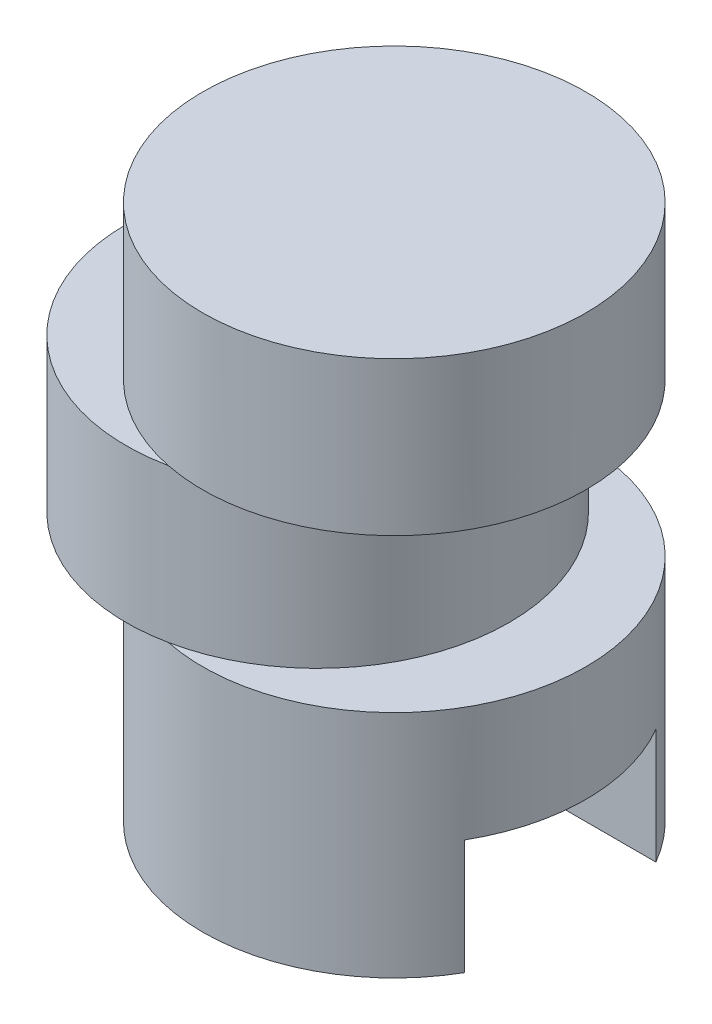
ISO-10303-21;
HEADER;
FILE_DESCRIPTION(('STEP AP214'),'2;1');
FILE_NAME('part.step','',(''),(''),'','','');
FILE_SCHEMA(('AUTOMOTIVE_DESIGN { 1 0 10303 214 1 1 1 1 }'));
ENDSEC;
DATA;
#1=APPLICATION_CONTEXT('core data for automotive mechanical design processes');
#2=APPLICATION_PROTOCOL_DEFINITION('international standard','automotive_design',2000,#1);
#3=PRODUCT_CONTEXT('',#1,'mechanical');
#4=PRODUCT('Part','Part','',(#3));
#5=PRODUCT_RELATED_PRODUCT_CATEGORY('part','',(#4));
#6=PRODUCT_DEFINITION_FORMATION('','',#4);
#7=PRODUCT_DEFINITION_CONTEXT('part definition',#1,'design');
#8=PRODUCT_DEFINITION('design','',#6,#7);
#9=PRODUCT_DEFINITION_SHAPE('','',#8);
#10=(LENGTH_UNIT() NAMED_UNIT(*) SI_UNIT(.MILLI.,.METRE.));
#11=(NAMED_UNIT(*) PLANE_ANGLE_UNIT() SI_UNIT($,.RADIAN.));
#12=(NAMED_UNIT(*) SI_UNIT($,.STERADIAN.) SOLID_ANGLE_UNIT());
#13=UNCERTAINTY_MEASURE_WITH_UNIT(LENGTH_MEASURE(1.E-05),#10,'distance_accuracy_value','');
#14=(GEOMETRIC_REPRESENTATION_CONTEXT(3) GLOBAL_UNCERTAINTY_ASSIGNED_CONTEXT((#13)) GLOBAL_UNIT_ASSIGNED_CONTEXT((#10,
#11,#12)) REPRESENTATION_CONTEXT('',''));
#15=CARTESIAN_POINT('',(0.,0.,0.));
#16=DIRECTION('',(0.,0.,1.));
#17=DIRECTION('',(1.,0.,0.));
#18=AXIS2_PLACEMENT_3D('',#15,#16,#17);
#19=CARTESIAN_POINT('',(0.,0.,0.));
#20=DIRECTION('',(0.,1.,0.));
#21=DIRECTION('',(0.,0.,1.));
#22=AXIS2_PLACEMENT_3D('',#19,#20,#21);
#23=PLANE('',#22);
#24=CARTESIAN_POINT('',(0.,0.,0.));
#25=DIRECTION('',(0.,1.,0.));
#26=DIRECTION('',(0.,0.,1.));
#27=AXIS2_PLACEMENT_3D('',#24,#25,#26);
#28=CIRCLE('',#27,5.);
#29=CARTESIAN_POINT('',(-4.33012701892219,0.,2.5));
#30=VERTEX_POINT('',#29);
#31=CARTESIAN_POINT('',(4.33012701892219,0.,2.5));
#32=VERTEX_POINT('',#31);
#33=EDGE_CURVE('E43',#30,#32,#28,.T.);
#34=ORIENTED_EDGE('',*,*,#33,.F.);
#35=DIRECTION('',(-1.,0.,0.));
#36=VECTOR('',#35,1.);
#37=CARTESIAN_POINT('',(-4.33012701892219,0.,2.5));
#38=LINE('',#37,#36);
#39=EDGE_CURVE('E112',#32,#30,#38,.T.);
#40=ORIENTED_EDGE('',*,*,#39,.F.);
#41=EDGE_LOOP('',(#34,#40));
#42=FACE_BOUND('',#41,.T.);
#43=ADVANCED_FACE('F39',(#42),#23,.F.);
#44=CARTESIAN_POINT('',(0.,6.,0.));
#45=DIRECTION('',(0.,-1.,0.));
#46=DIRECTION('',(0.,0.,-1.));
#47=AXIS2_PLACEMENT_3D('',#44,#45,#46);
#48=CYLINDRICAL_SURFACE('',#47,5.);
#49=ORIENTED_EDGE('',*,*,#33,.T.);
#50=DIRECTION('',(0.,-1.,0.));
#51=VECTOR('',#50,1.);
#52=CARTESIAN_POINT('',(4.33012701892219,3.,2.5));
#53=LINE('',#52,#51);
#54=CARTESIAN_POINT('',(4.33012701892219,3.,2.5));
#55=VERTEX_POINT('',#54);
#56=EDGE_CURVE('E123',#55,#32,#53,.T.);
#57=ORIENTED_EDGE('',*,*,#56,.F.);
#58=CARTESIAN_POINT('',(0.,3.,0.));
#59=DIRECTION('',(0.,-1.,0.));
#60=DIRECTION('',(0.,0.,-1.));
#61=AXIS2_PLACEMENT_3D('',#58,#59,#60);
#62=CIRCLE('',#61,5.);
#63=CARTESIAN_POINT('',(4.33012701892219,3.,-2.5));
#64=VERTEX_POINT('',#63);
#65=EDGE_CURVE('E101',#64,#55,#62,.T.);
#66=ORIENTED_EDGE('',*,*,#65,.F.);
#67=DIRECTION('',(0.,-1.,0.));
#68=VECTOR('',#67,1.);
#69=CARTESIAN_POINT('',(4.33012701892219,3.,-2.5));
#70=LINE('',#69,#68);
#71=CARTESIAN_POINT('',(4.33012701892219,0.,-2.5));
#72=VERTEX_POINT('',#71);
#73=EDGE_CURVE('E97',#64,#72,#70,.T.);
#74=ORIENTED_EDGE('',*,*,#73,.T.);
#75=CARTESIAN_POINT('',(-4.33012701892219,0.,-2.5));
#76=VERTEX_POINT('',#75);
#77=EDGE_CURVE('E118',#72,#76,#28,.T.);
#78=ORIENTED_EDGE('',*,*,#77,.T.);
#79=DIRECTION('',(0.,-1.,0.));
#80=VECTOR('',#79,1.);
#81=CARTESIAN_POINT('',(-4.33012701892219,3.,-2.5));
#82=LINE('',#81,#80);
#83=CARTESIAN_POINT('',(-4.33012701892219,3.,-2.5));
#84=VERTEX_POINT('',#83);
#85=EDGE_CURVE('E56',#84,#76,#82,.T.);
#86=ORIENTED_EDGE('',*,*,#85,.F.);
#87=CARTESIAN_POINT('',(0.,3.,0.));
#88=DIRECTION('',(0.,-1.,0.));
#89=DIRECTION('',(0.,0.,-1.));
#90=AXIS2_PLACEMENT_3D('',#87,#88,#89);
#91=CIRCLE('',#90,5.);
#92=CARTESIAN_POINT('',(-4.33012701892219,3.,2.5));
#93=VERTEX_POINT('',#92);
#94=EDGE_CURVE('E102',#93,#84,#91,.T.);
#95=ORIENTED_EDGE('',*,*,#94,.F.);
#96=DIRECTION('',(0.,-1.,0.));
#97=VECTOR('',#96,1.);
#98=CARTESIAN_POINT('',(-4.33012701892219,3.,2.5));
#99=LINE('',#98,#97);
#100=EDGE_CURVE('E161',#93,#30,#99,.T.);
#101=ORIENTED_EDGE('',*,*,#100,.T.);
#102=EDGE_LOOP('',(#49,#57,#66,#74,#78,#86,#95,#101));
#103=FACE_BOUND('',#102,.T.);
#104=CARTESIAN_POINT('',(0.,6.,0.));
#105=DIRECTION('',(0.,1.,0.));
#106=DIRECTION('',(0.,0.,1.));
#107=AXIS2_PLACEMENT_3D('',#104,#105,#106);
#108=CIRCLE('',#107,5.);
#109=CARTESIAN_POINT('',(-1.,6.,-4.89897948556636));
#110=VERTEX_POINT('',#109);
#111=CARTESIAN_POINT('',(-1.,6.,4.89897948556636));
#112=VERTEX_POINT('',#111);
#113=EDGE_CURVE('E11',#110,#112,#108,.T.);
#114=ORIENTED_EDGE('',*,*,#113,.F.);
#115=EDGE_CURVE('E49',#112,#110,#108,.T.);
#116=ORIENTED_EDGE('',*,*,#115,.F.);
#117=EDGE_LOOP('',(#114,#116));
#118=FACE_BOUND('',#117,.T.);
#119=ADVANCED_FACE('F41',(#103,#118),#48,.T.);
#120=CARTESIAN_POINT('',(0.,6.,0.));
#121=DIRECTION('',(0.,1.,0.));
#122=DIRECTION('',(0.,0.,1.));
#123=AXIS2_PLACEMENT_3D('',#120,#121,#122);
#124=PLANE('',#123);
#125=CARTESIAN_POINT('',(-2.,6.,0.));
#126=DIRECTION('',(0.,1.,0.));
#127=DIRECTION('',(0.,0.,1.));
#128=AXIS2_PLACEMENT_3D('',#125,#126,#127);
#129=CIRCLE('',#128,5.);
#130=EDGE_CURVE('E141',#112,#110,#129,.T.);
#131=ORIENTED_EDGE('',*,*,#130,.F.);
#132=ORIENTED_EDGE('',*,*,#115,.T.);
#133=EDGE_LOOP('',(#131,#132));
#134=FACE_BOUND('',#133,.T.);
#135=ADVANCED_FACE('F155',(#134),#124,.T.);
#136=ORIENTED_EDGE('',*,*,#77,.F.);
#137=DIRECTION('',(1.,0.,0.));
#138=VECTOR('',#137,1.);
#139=CARTESIAN_POINT('',(-4.33012701892219,0.,-2.5));
#140=LINE('',#139,#138);
#141=EDGE_CURVE('E166',#76,#72,#140,.T.);
#142=ORIENTED_EDGE('',*,*,#141,.F.);
#143=EDGE_LOOP('',(#136,#142));
#144=FACE_BOUND('',#143,.T.);
#145=ADVANCED_FACE('F187',(#144),#23,.F.);
#146=CARTESIAN_POINT('',(-2.,6.,0.));
#147=DIRECTION('',(0.,1.,0.));
#148=DIRECTION('',(0.,0.,1.));
#149=AXIS2_PLACEMENT_3D('',#146,#147,#148);
#150=PLANE('',#149);
#151=EDGE_CURVE('E132',#110,#112,#129,.T.);
#152=ORIENTED_EDGE('',*,*,#151,.F.);
#153=ORIENTED_EDGE('',*,*,#113,.T.);
#154=EDGE_LOOP('',(#152,#153));
#155=FACE_BOUND('',#154,.T.);
#156=ADVANCED_FACE('F151',(#155),#150,.F.);
#157=CARTESIAN_POINT('',(-2.,10.,0.));
#158=DIRECTION('',(0.,-1.,0.));
#159=DIRECTION('',(0.,0.,-1.));
#160=AXIS2_PLACEMENT_3D('',#157,#158,#159);
#161=CYLINDRICAL_SURFACE('',#160,5.);
#162=CARTESIAN_POINT('',(-2.,10.,0.));
#163=DIRECTION('',(0.,1.,0.));
#164=DIRECTION('',(0.,0.,1.));
#165=AXIS2_PLACEMENT_3D('',#162,#163,#164);
#166=CIRCLE('',#165,5.);
#167=CARTESIAN_POINT('',(-1.,10.,4.89897948556636));
#168=VERTEX_POINT('',#167);
#169=CARTESIAN_POINT('',(-1.,10.,-4.89897948556636));
#170=VERTEX_POINT('',#169);
#171=EDGE_CURVE('E136',#168,#170,#166,.T.);
#172=ORIENTED_EDGE('',*,*,#171,.F.);
#173=EDGE_CURVE('E140',#170,#168,#166,.T.);
#174=ORIENTED_EDGE('',*,*,#173,.F.);
#175=EDGE_LOOP('',(#172,#174));
#176=FACE_BOUND('',#175,.T.);
#177=ORIENTED_EDGE('',*,*,#130,.T.);
#178=ORIENTED_EDGE('',*,*,#151,.T.);
#179=EDGE_LOOP('',(#177,#178));
#180=FACE_BOUND('',#179,.T.);
#181=ADVANCED_FACE('F149',(#176,#180),#161,.T.);
#182=CARTESIAN_POINT('',(-2.,10.,0.));
#183=DIRECTION('',(0.,1.,0.));
#184=DIRECTION('',(0.,0.,1.));
#185=AXIS2_PLACEMENT_3D('',#182,#183,#184);
#186=PLANE('',#185);
#187=CARTESIAN_POINT('',(0.,10.,0.));
#188=DIRECTION('',(0.,1.,0.));
#189=DIRECTION('',(0.,0.,1.));
#190=AXIS2_PLACEMENT_3D('',#187,#188,#189);
#191=CIRCLE('',#190,5.);
#192=EDGE_CURVE('E63',#170,#168,#191,.T.);
#193=ORIENTED_EDGE('',*,*,#192,.F.);
#194=ORIENTED_EDGE('',*,*,#173,.T.);
#195=EDGE_LOOP('',(#193,#194));
#196=FACE_BOUND('',#195,.T.);
#197=ADVANCED_FACE('F205',(#196),#186,.T.);
#198=CARTESIAN_POINT('',(0.,10.,0.));
#199=DIRECTION('',(0.,1.,0.));
#200=DIRECTION('',(0.,0.,1.));
#201=AXIS2_PLACEMENT_3D('',#198,#199,#200);
#202=PLANE('',#201);
#203=EDGE_CURVE('E135',#168,#170,#191,.T.);
#204=ORIENTED_EDGE('',*,*,#203,.F.);
#205=ORIENTED_EDGE('',*,*,#171,.T.);
#206=EDGE_LOOP('',(#204,#205));
#207=FACE_BOUND('',#206,.T.);
#208=ADVANCED_FACE('F210',(#207),#202,.F.);
#209=CARTESIAN_POINT('',(0.,14.,0.));
#210=DIRECTION('',(0.,-1.,0.));
#211=DIRECTION('',(0.,0.,-1.));
#212=AXIS2_PLACEMENT_3D('',#209,#210,#211);
#213=CYLINDRICAL_SURFACE('',#212,5.);
#214=CARTESIAN_POINT('',(0.,14.,0.));
#215=DIRECTION('',(0.,1.,0.));
#216=DIRECTION('',(0.,0.,1.));
#217=AXIS2_PLACEMENT_3D('',#214,#215,#216);
#218=CIRCLE('',#217,5.);
#219=CARTESIAN_POINT('',(0.,14.,5.));
#220=VERTEX_POINT('',#219);
#221=EDGE_CURVE('E128',#220,#220,#218,.T.);
#222=ORIENTED_EDGE('',*,*,#221,.F.);
#223=EDGE_LOOP('',(#222));
#224=FACE_BOUND('',#223,.T.);
#225=ORIENTED_EDGE('',*,*,#192,.T.);
#226=ORIENTED_EDGE('',*,*,#203,.T.);
#227=EDGE_LOOP('',(#225,#226));
#228=FACE_BOUND('',#227,.T.);
#229=ADVANCED_FACE('F182',(#224,#228),#213,.T.);
#230=CARTESIAN_POINT('',(0.,14.,0.));
#231=DIRECTION('',(0.,1.,0.));
#232=DIRECTION('',(0.,0.,1.));
#233=AXIS2_PLACEMENT_3D('',#230,#231,#232);
#234=PLANE('',#233);
#235=ORIENTED_EDGE('',*,*,#221,.T.);
#236=EDGE_LOOP('',(#235));
#237=FACE_BOUND('',#236,.T.);
#238=ADVANCED_FACE('F175',(#237),#234,.T.);
#239=CARTESIAN_POINT('',(-4.33012701892219,3.,2.5));
#240=DIRECTION('',(0.,0.,1.));
#241=DIRECTION('',(1.,0.,0.));
#242=AXIS2_PLACEMENT_3D('',#239,#240,#241);
#243=PLANE('',#242);
#244=ORIENTED_EDGE('',*,*,#39,.T.);
#245=ORIENTED_EDGE('',*,*,#100,.F.);
#246=DIRECTION('',(-1.,0.,0.));
#247=VECTOR('',#246,1.);
#248=CARTESIAN_POINT('',(-4.33012701892219,3.,2.5));
#249=LINE('',#248,#247);
#250=EDGE_CURVE('E108',#55,#93,#249,.T.);
#251=ORIENTED_EDGE('',*,*,#250,.F.);
#252=ORIENTED_EDGE('',*,*,#56,.T.);
#253=EDGE_LOOP('',(#244,#245,#251,#252));
#254=FACE_BOUND('',#253,.T.);
#255=ADVANCED_FACE('F173',(#254),#243,.F.);
#256=CARTESIAN_POINT('',(-4.33012701892219,3.,-2.5));
#257=DIRECTION('',(0.,0.,-1.));
#258=DIRECTION('',(-1.,0.,0.));
#259=AXIS2_PLACEMENT_3D('',#256,#257,#258);
#260=PLANE('',#259);
#261=ORIENTED_EDGE('',*,*,#141,.T.);
#262=ORIENTED_EDGE('',*,*,#73,.F.);
#263=DIRECTION('',(1.,0.,0.));
#264=VECTOR('',#263,1.);
#265=CARTESIAN_POINT('',(-4.33012701892219,3.,-2.5));
#266=LINE('',#265,#264);
#267=EDGE_CURVE('E93',#84,#64,#266,.T.);
#268=ORIENTED_EDGE('',*,*,#267,.F.);
#269=ORIENTED_EDGE('',*,*,#85,.T.);
#270=EDGE_LOOP('',(#261,#262,#268,#269));
#271=FACE_BOUND('',#270,.T.);
#272=ADVANCED_FACE('F95',(#271),#260,.F.);
#273=CARTESIAN_POINT('',(0.,3.,0.));
#274=DIRECTION('',(0.,-1.,0.));
#275=DIRECTION('',(0.,0.,-1.));
#276=AXIS2_PLACEMENT_3D('',#273,#274,#275);
#277=PLANE('',#276);
#278=ORIENTED_EDGE('',*,*,#94,.T.);
#279=ORIENTED_EDGE('',*,*,#267,.T.);
#280=ORIENTED_EDGE('',*,*,#65,.T.);
#281=ORIENTED_EDGE('',*,*,#250,.T.);
#282=EDGE_LOOP('',(#278,#279,#280,#281));
#283=FACE_BOUND('',#282,.T.);
#284=ADVANCED_FACE('F106',(#283),#277,.T.);
#285=CLOSED_SHELL('',(#43,#119,#135,#145,#156,#181,#197,#208,#229,#238,#255,#272,#284));
#286=MANIFOLD_SOLID_BREP('B2',#285);
#287=ADVANCED_BREP_SHAPE_REPRESENTATION('',(#18,#286),#14);
#288=SHAPE_DEFINITION_REPRESENTATION(#9,#287);
ENDSEC;
END-ISO-10303-21;
